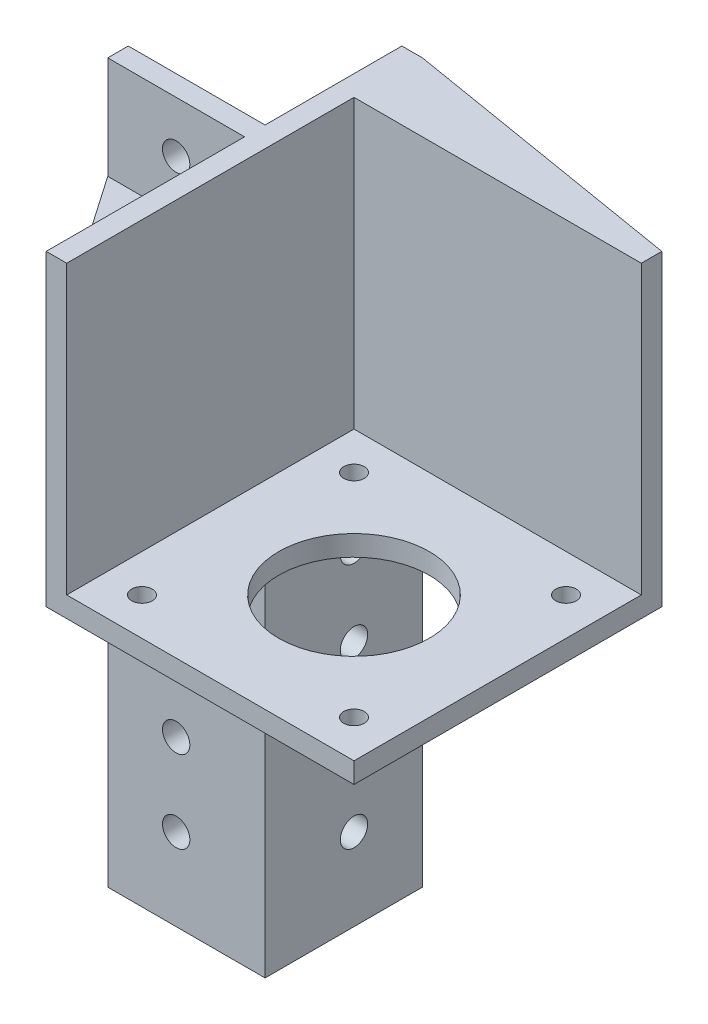
ISO-10303-21;
HEADER;
FILE_DESCRIPTION(('STEP AP214'),'2;1');
FILE_NAME('part.step','',(''),(''),'','','');
FILE_SCHEMA(('AUTOMOTIVE_DESIGN { 1 0 10303 214 1 1 1 1 }'));
ENDSEC;
DATA;
#1=APPLICATION_CONTEXT('core data for automotive mechanical design processes');
#2=APPLICATION_PROTOCOL_DEFINITION('international standard','automotive_design',2000,#1);
#3=PRODUCT_CONTEXT('',#1,'mechanical');
#4=PRODUCT('Part','Part','',(#3));
#5=PRODUCT_RELATED_PRODUCT_CATEGORY('part','',(#4));
#6=PRODUCT_DEFINITION_FORMATION('','',#4);
#7=PRODUCT_DEFINITION_CONTEXT('part definition',#1,'design');
#8=PRODUCT_DEFINITION('design','',#6,#7);
#9=PRODUCT_DEFINITION_SHAPE('','',#8);
#10=(LENGTH_UNIT() NAMED_UNIT(*) SI_UNIT(.MILLI.,.METRE.));
#11=(NAMED_UNIT(*) PLANE_ANGLE_UNIT() SI_UNIT($,.RADIAN.));
#12=(NAMED_UNIT(*) SI_UNIT($,.STERADIAN.) SOLID_ANGLE_UNIT());
#13=UNCERTAINTY_MEASURE_WITH_UNIT(LENGTH_MEASURE(1.E-05),#10,'distance_accuracy_value','');
#14=(GEOMETRIC_REPRESENTATION_CONTEXT(3) GLOBAL_UNCERTAINTY_ASSIGNED_CONTEXT((#13)) GLOBAL_UNIT_ASSIGNED_CONTEXT((#10,
#11,#12)) REPRESENTATION_CONTEXT('',''));
#15=CARTESIAN_POINT('',(0.,0.,0.));
#16=DIRECTION('',(0.,0.,1.));
#17=DIRECTION('',(1.,0.,0.));
#18=AXIS2_PLACEMENT_3D('',#15,#16,#17);
#19=CARTESIAN_POINT('',(0.,0.,-8.));
#20=DIRECTION('',(0.,0.,1.));
#21=DIRECTION('',(1.,0.,0.));
#22=AXIS2_PLACEMENT_3D('',#19,#20,#21);
#23=PLANE('',#22);
#24=CARTESIAN_POINT('',(-34.,-12.,-8.));
#25=DIRECTION('',(0.,0.,1.));
#26=DIRECTION('',(1.,0.,0.));
#27=AXIS2_PLACEMENT_3D('',#24,#25,#26);
#28=CIRCLE('',#27,2.);
#29=CARTESIAN_POINT('',(-32.,-12.,-8.));
#30=VERTEX_POINT('',#29);
#31=EDGE_CURVE('E188',#30,#30,#28,.T.);
#32=ORIENTED_EDGE('',*,*,#31,.F.);
#33=EDGE_LOOP('',(#32));
#34=FACE_BOUND('',#33,.T.);
#35=CARTESIAN_POINT('',(-34.,-24.,-8.));
#36=DIRECTION('',(0.,0.,1.));
#37=DIRECTION('',(1.,0.,0.));
#38=AXIS2_PLACEMENT_3D('',#35,#36,#37);
#39=CIRCLE('',#38,2.);
#40=CARTESIAN_POINT('',(-32.,-24.,-8.));
#41=VERTEX_POINT('',#40);
#42=EDGE_CURVE('E191',#41,#41,#39,.T.);
#43=ORIENTED_EDGE('',*,*,#42,.F.);
#44=EDGE_LOOP('',(#43));
#45=FACE_BOUND('',#44,.T.);
#46=CARTESIAN_POINT('',(-34.,-36.,-8.));
#47=DIRECTION('',(0.,0.,1.));
#48=DIRECTION('',(1.,0.,0.));
#49=AXIS2_PLACEMENT_3D('',#46,#47,#48);
#50=CIRCLE('',#49,2.);
#51=CARTESIAN_POINT('',(-32.,-36.,-8.));
#52=VERTEX_POINT('',#51);
#53=EDGE_CURVE('E177',#52,#52,#50,.T.);
#54=ORIENTED_EDGE('',*,*,#53,.F.);
#55=EDGE_LOOP('',(#54));
#56=FACE_BOUND('',#55,.T.);
#57=CARTESIAN_POINT('',(-34.,-48.,-8.));
#58=DIRECTION('',(0.,0.,1.));
#59=DIRECTION('',(1.,0.,0.));
#60=AXIS2_PLACEMENT_3D('',#57,#58,#59);
#61=CIRCLE('',#60,2.);
#62=CARTESIAN_POINT('',(-32.,-48.,-8.));
#63=VERTEX_POINT('',#62);
#64=EDGE_CURVE('E173',#63,#63,#61,.T.);
#65=ORIENTED_EDGE('',*,*,#64,.F.);
#66=EDGE_LOOP('',(#65));
#67=FACE_BOUND('',#66,.T.);
#68=DIRECTION('',(-1.,0.,0.));
#69=VECTOR('',#68,1.);
#70=CARTESIAN_POINT('',(-21.,0.,-8.));
#71=LINE('',#70,#69);
#72=CARTESIAN_POINT('',(-21.,0.,-8.));
#73=VERTEX_POINT('',#72);
#74=CARTESIAN_POINT('',(-44.,0.,-8.));
#75=VERTEX_POINT('',#74);
#76=EDGE_CURVE('E63',#73,#75,#71,.T.);
#77=ORIENTED_EDGE('',*,*,#76,.T.);
#78=DIRECTION('',(0.,-1.,0.));
#79=VECTOR('',#78,1.);
#80=CARTESIAN_POINT('',(-44.,45.,-8.));
#81=LINE('',#80,#79);
#82=CARTESIAN_POINT('',(-44.,-60.,-8.));
#83=VERTEX_POINT('',#82);
#84=EDGE_CURVE('E218',#75,#83,#81,.T.);
#85=ORIENTED_EDGE('',*,*,#84,.T.);
#86=DIRECTION('',(1.,0.,0.));
#87=VECTOR('',#86,1.);
#88=CARTESIAN_POINT('',(-44.,-60.,-8.));
#89=LINE('',#88,#87);
#90=CARTESIAN_POINT('',(-21.,-60.,-8.));
#91=VERTEX_POINT('',#90);
#92=EDGE_CURVE('E222',#83,#91,#89,.T.);
#93=ORIENTED_EDGE('',*,*,#92,.T.);
#94=DIRECTION('',(0.,1.,0.));
#95=VECTOR('',#94,1.);
#96=CARTESIAN_POINT('',(-21.,0.,-8.));
#97=LINE('',#96,#95);
#98=EDGE_CURVE('E210',#91,#73,#97,.T.);
#99=ORIENTED_EDGE('',*,*,#98,.T.);
#100=EDGE_LOOP('',(#77,#85,#93,#99));
#101=FACE_BOUND('',#100,.T.);
#102=ADVANCED_FACE('F39',(#34,#45,#56,#67,#101),#23,.T.);
#103=CARTESIAN_POINT('',(0.,0.,0.));
#104=DIRECTION('',(0.,1.,0.));
#105=DIRECTION('',(0.,0.,1.));
#106=AXIS2_PLACEMENT_3D('',#103,#104,#105);
#107=PLANE('',#106);
#108=CARTESIAN_POINT('',(15.5,0.,-15.5));
#109=DIRECTION('',(0.,1.,0.));
#110=DIRECTION('',(0.,0.,1.));
#111=AXIS2_PLACEMENT_3D('',#108,#109,#110);
#112=CIRCLE('',#111,1.5);
#113=CARTESIAN_POINT('',(15.5,0.,-14.));
#114=VERTEX_POINT('',#113);
#115=EDGE_CURVE('E271',#114,#114,#112,.T.);
#116=ORIENTED_EDGE('',*,*,#115,.T.);
#117=EDGE_LOOP('',(#116));
#118=FACE_BOUND('',#117,.T.);
#119=CARTESIAN_POINT('',(-15.5,0.,-15.5));
#120=DIRECTION('',(0.,1.,0.));
#121=DIRECTION('',(0.,0.,-1.));
#122=AXIS2_PLACEMENT_3D('',#119,#120,#121);
#123=CIRCLE('',#122,1.5);
#124=CARTESIAN_POINT('',(-15.5,0.,-17.));
#125=VERTEX_POINT('',#124);
#126=EDGE_CURVE('E275',#125,#125,#123,.T.);
#127=ORIENTED_EDGE('',*,*,#126,.T.);
#128=EDGE_LOOP('',(#127));
#129=FACE_BOUND('',#128,.T.);
#130=CARTESIAN_POINT('',(15.5,0.,15.5));
#131=DIRECTION('',(0.,1.,0.));
#132=DIRECTION('',(0.,0.,-1.));
#133=AXIS2_PLACEMENT_3D('',#130,#131,#132);
#134=CIRCLE('',#133,1.5);
#135=CARTESIAN_POINT('',(15.5,0.,14.));
#136=VERTEX_POINT('',#135);
#137=EDGE_CURVE('E281',#136,#136,#134,.T.);
#138=ORIENTED_EDGE('',*,*,#137,.T.);
#139=EDGE_LOOP('',(#138));
#140=FACE_BOUND('',#139,.T.);
#141=CARTESIAN_POINT('',(-15.5,0.,15.5));
#142=DIRECTION('',(0.,1.,0.));
#143=DIRECTION('',(0.,0.,1.));
#144=AXIS2_PLACEMENT_3D('',#141,#142,#143);
#145=CIRCLE('',#144,1.5);
#146=CARTESIAN_POINT('',(-15.5,0.,17.));
#147=VERTEX_POINT('',#146);
#148=EDGE_CURVE('E287',#147,#147,#145,.T.);
#149=ORIENTED_EDGE('',*,*,#148,.T.);
#150=EDGE_LOOP('',(#149));
#151=FACE_BOUND('',#150,.T.);
#152=CARTESIAN_POINT('',(0.,0.,0.));
#153=DIRECTION('',(0.,1.,0.));
#154=DIRECTION('',(0.,0.,1.));
#155=AXIS2_PLACEMENT_3D('',#152,#153,#154);
#156=CIRCLE('',#155,11.);
#157=CARTESIAN_POINT('',(0.,0.,11.));
#158=VERTEX_POINT('',#157);
#159=EDGE_CURVE('E293',#158,#158,#156,.T.);
#160=ORIENTED_EDGE('',*,*,#159,.T.);
#161=EDGE_LOOP('',(#160));
#162=FACE_BOUND('',#161,.T.);
#163=ORIENTED_EDGE('',*,*,#76,.F.);
#164=DIRECTION('',(0.,0.,1.));
#165=VECTOR('',#164,1.);
#166=CARTESIAN_POINT('',(-21.,0.,-21.));
#167=LINE('',#166,#165);
#168=CARTESIAN_POINT('',(-21.,0.,-31.));
#169=VERTEX_POINT('',#168);
#170=EDGE_CURVE('E56',#169,#73,#167,.T.);
#171=ORIENTED_EDGE('',*,*,#170,.F.);
#172=DIRECTION('',(0.986393923832144,0.,0.164398987305357));
#173=VECTOR('',#172,1.);
#174=CARTESIAN_POINT('',(21.,0.,-24.));
#175=LINE('',#174,#173);
#176=CARTESIAN_POINT('',(21.,0.,-24.));
#177=VERTEX_POINT('',#176);
#178=EDGE_CURVE('E174',#169,#177,#175,.T.);
#179=ORIENTED_EDGE('',*,*,#178,.T.);
#180=DIRECTION('',(0.,0.,-1.));
#181=VECTOR('',#180,1.);
#182=CARTESIAN_POINT('',(21.,0.,-21.));
#183=LINE('',#182,#181);
#184=CARTESIAN_POINT('',(21.,0.,21.));
#185=VERTEX_POINT('',#184);
#186=EDGE_CURVE('E155',#185,#177,#183,.T.);
#187=ORIENTED_EDGE('',*,*,#186,.F.);
#188=DIRECTION('',(1.,0.,0.));
#189=VECTOR('',#188,1.);
#190=CARTESIAN_POINT('',(-21.,0.,21.));
#191=LINE('',#190,#189);
#192=CARTESIAN_POINT('',(-24.,0.,21.));
#193=VERTEX_POINT('',#192);
#194=EDGE_CURVE('E305',#193,#185,#191,.T.);
#195=ORIENTED_EDGE('',*,*,#194,.F.);
#196=DIRECTION('',(-0.567732955803659,0.,-0.823212785915307));
#197=VECTOR('',#196,1.);
#198=CARTESIAN_POINT('',(-24.,0.,21.));
#199=LINE('',#198,#197);
#200=EDGE_CURVE('E200',#193,#75,#199,.T.);
#201=ORIENTED_EDGE('',*,*,#200,.T.);
#202=EDGE_LOOP('',(#163,#171,#179,#187,#195,#201));
#203=FACE_BOUND('',#202,.T.);
#204=ADVANCED_FACE('F345',(#118,#129,#140,#151,#162,#203),#107,.F.);
#205=CARTESIAN_POINT('',(-24.,0.,0.));
#206=DIRECTION('',(-1.,0.,0.));
#207=DIRECTION('',(0.,0.,1.));
#208=AXIS2_PLACEMENT_3D('',#205,#206,#207);
#209=PLANE('',#208);
#210=CARTESIAN_POINT('',(-24.,-48.,-21.));
#211=DIRECTION('',(-1.,0.,0.));
#212=DIRECTION('',(0.,0.,1.));
#213=AXIS2_PLACEMENT_3D('',#210,#211,#212);
#214=CIRCLE('',#213,2.);
#215=CARTESIAN_POINT('',(-24.,-48.,-19.));
#216=VERTEX_POINT('',#215);
#217=EDGE_CURVE('E179',#216,#216,#214,.T.);
#218=ORIENTED_EDGE('',*,*,#217,.F.);
#219=EDGE_LOOP('',(#218));
#220=FACE_BOUND('',#219,.T.);
#221=CARTESIAN_POINT('',(-24.,-36.,-21.));
#222=DIRECTION('',(-1.,0.,0.));
#223=DIRECTION('',(0.,0.,1.));
#224=AXIS2_PLACEMENT_3D('',#221,#222,#223);
#225=CIRCLE('',#224,2.);
#226=CARTESIAN_POINT('',(-24.,-36.,-19.));
#227=VERTEX_POINT('',#226);
#228=EDGE_CURVE('E697',#227,#227,#225,.T.);
#229=ORIENTED_EDGE('',*,*,#228,.F.);
#230=EDGE_LOOP('',(#229));
#231=FACE_BOUND('',#230,.T.);
#232=CARTESIAN_POINT('',(-24.,-12.,-21.));
#233=DIRECTION('',(-1.,0.,0.));
#234=DIRECTION('',(0.,0.,1.));
#235=AXIS2_PLACEMENT_3D('',#232,#233,#234);
#236=CIRCLE('',#235,2.);
#237=CARTESIAN_POINT('',(-24.,-12.,-19.));
#238=VERTEX_POINT('',#237);
#239=EDGE_CURVE('E695',#238,#238,#236,.T.);
#240=ORIENTED_EDGE('',*,*,#239,.F.);
#241=EDGE_LOOP('',(#240));
#242=FACE_BOUND('',#241,.T.);
#243=CARTESIAN_POINT('',(-24.,-24.,-21.));
#244=DIRECTION('',(-1.,0.,0.));
#245=DIRECTION('',(0.,0.,1.));
#246=AXIS2_PLACEMENT_3D('',#243,#244,#245);
#247=CIRCLE('',#246,2.);
#248=CARTESIAN_POINT('',(-24.,-24.,-19.));
#249=VERTEX_POINT('',#248);
#250=EDGE_CURVE('E692',#249,#249,#247,.T.);
#251=ORIENTED_EDGE('',*,*,#250,.F.);
#252=EDGE_LOOP('',(#251));
#253=FACE_BOUND('',#252,.T.);
#254=DIRECTION('',(0.,1.,0.));
#255=VECTOR('',#254,1.);
#256=CARTESIAN_POINT('',(-24.,0.,-11.));
#257=LINE('',#256,#255);
#258=CARTESIAN_POINT('',(-24.,-60.,-11.));
#259=VERTEX_POINT('',#258);
#260=CARTESIAN_POINT('',(-24.,45.,-11.));
#261=VERTEX_POINT('',#260);
#262=EDGE_CURVE('E254',#259,#261,#257,.T.);
#263=ORIENTED_EDGE('',*,*,#262,.T.);
#264=DIRECTION('',(0.,0.,-1.));
#265=VECTOR('',#264,1.);
#266=CARTESIAN_POINT('',(-24.,45.,-31.));
#267=LINE('',#266,#265);
#268=CARTESIAN_POINT('',(-24.,45.,-31.));
#269=VERTEX_POINT('',#268);
#270=EDGE_CURVE('E244',#261,#269,#267,.T.);
#271=ORIENTED_EDGE('',*,*,#270,.T.);
#272=DIRECTION('',(0.,-1.,0.));
#273=VECTOR('',#272,1.);
#274=CARTESIAN_POINT('',(-24.,-60.,-31.));
#275=LINE('',#274,#273);
#276=CARTESIAN_POINT('',(-24.,-60.,-31.));
#277=VERTEX_POINT('',#276);
#278=EDGE_CURVE('E249',#269,#277,#275,.T.);
#279=ORIENTED_EDGE('',*,*,#278,.T.);
#280=DIRECTION('',(0.,0.,1.));
#281=VECTOR('',#280,1.);
#282=CARTESIAN_POINT('',(-24.,-60.,-11.));
#283=LINE('',#282,#281);
#284=EDGE_CURVE('E251',#277,#259,#283,.T.);
#285=ORIENTED_EDGE('',*,*,#284,.T.);
#286=EDGE_LOOP('',(#263,#271,#279,#285));
#287=FACE_BOUND('',#286,.T.);
#288=ADVANCED_FACE('F354',(#220,#231,#242,#253,#287),#209,.T.);
#289=CARTESIAN_POINT('',(-21.,0.,0.));
#290=DIRECTION('',(-1.,0.,0.));
#291=DIRECTION('',(0.,0.,1.));
#292=AXIS2_PLACEMENT_3D('',#289,#290,#291);
#293=PLANE('',#292);
#294=CARTESIAN_POINT('',(-21.,-48.,-21.));
#295=DIRECTION('',(1.,0.,0.));
#296=DIRECTION('',(0.,0.,-1.));
#297=AXIS2_PLACEMENT_3D('',#294,#295,#296);
#298=CIRCLE('',#297,2.);
#299=CARTESIAN_POINT('',(-21.,-48.,-23.));
#300=VERTEX_POINT('',#299);
#301=EDGE_CURVE('E681',#300,#300,#298,.T.);
#302=ORIENTED_EDGE('',*,*,#301,.F.);
#303=EDGE_LOOP('',(#302));
#304=FACE_BOUND('',#303,.T.);
#305=CARTESIAN_POINT('',(-21.,-36.,-21.));
#306=DIRECTION('',(1.,0.,0.));
#307=DIRECTION('',(0.,0.,-1.));
#308=AXIS2_PLACEMENT_3D('',#305,#306,#307);
#309=CIRCLE('',#308,2.);
#310=CARTESIAN_POINT('',(-21.,-36.,-23.));
#311=VERTEX_POINT('',#310);
#312=EDGE_CURVE('E682',#311,#311,#309,.T.);
#313=ORIENTED_EDGE('',*,*,#312,.F.);
#314=EDGE_LOOP('',(#313));
#315=FACE_BOUND('',#314,.T.);
#316=CARTESIAN_POINT('',(-21.,-12.,-21.));
#317=DIRECTION('',(1.,0.,0.));
#318=DIRECTION('',(0.,0.,-1.));
#319=AXIS2_PLACEMENT_3D('',#316,#317,#318);
#320=CIRCLE('',#319,2.);
#321=CARTESIAN_POINT('',(-21.,-12.,-23.));
#322=VERTEX_POINT('',#321);
#323=EDGE_CURVE('E685',#322,#322,#320,.T.);
#324=ORIENTED_EDGE('',*,*,#323,.F.);
#325=EDGE_LOOP('',(#324));
#326=FACE_BOUND('',#325,.T.);
#327=CARTESIAN_POINT('',(-21.,-24.,-21.));
#328=DIRECTION('',(1.,0.,0.));
#329=DIRECTION('',(0.,0.,-1.));
#330=AXIS2_PLACEMENT_3D('',#327,#328,#329);
#331=CIRCLE('',#330,2.);
#332=CARTESIAN_POINT('',(-21.,-24.,-23.));
#333=VERTEX_POINT('',#332);
#334=EDGE_CURVE('E689',#333,#333,#331,.T.);
#335=ORIENTED_EDGE('',*,*,#334,.F.);
#336=EDGE_LOOP('',(#335));
#337=FACE_BOUND('',#336,.T.);
#338=DIRECTION('',(0.,-1.,0.));
#339=VECTOR('',#338,1.);
#340=CARTESIAN_POINT('',(-21.,-60.,-31.));
#341=LINE('',#340,#339);
#342=CARTESIAN_POINT('',(-21.,-60.,-31.));
#343=VERTEX_POINT('',#342);
#344=EDGE_CURVE('E260',#169,#343,#341,.T.);
#345=ORIENTED_EDGE('',*,*,#344,.F.);
#346=ORIENTED_EDGE('',*,*,#170,.T.);
#347=ORIENTED_EDGE('',*,*,#98,.F.);
#348=DIRECTION('',(0.,0.,1.));
#349=VECTOR('',#348,1.);
#350=CARTESIAN_POINT('',(-21.,-60.,-11.));
#351=LINE('',#350,#349);
#352=EDGE_CURVE('E262',#343,#91,#351,.T.);
#353=ORIENTED_EDGE('',*,*,#352,.F.);
#354=EDGE_LOOP('',(#345,#346,#347,#353));
#355=FACE_BOUND('',#354,.T.);
#356=ADVANCED_FACE('F435',(#304,#315,#326,#337,#355),#293,.F.);
#357=CARTESIAN_POINT('',(0.,3.,0.));
#358=DIRECTION('',(0.,1.,0.));
#359=DIRECTION('',(0.,0.,1.));
#360=AXIS2_PLACEMENT_3D('',#357,#358,#359);
#361=PLANE('',#360);
#362=CARTESIAN_POINT('',(-15.5,3.,-15.5));
#363=DIRECTION('',(0.,1.,0.));
#364=DIRECTION('',(0.,0.,-1.));
#365=AXIS2_PLACEMENT_3D('',#362,#363,#364);
#366=CIRCLE('',#365,1.5);
#367=CARTESIAN_POINT('',(-15.5,3.,-17.));
#368=VERTEX_POINT('',#367);
#369=EDGE_CURVE('E278',#368,#368,#366,.T.);
#370=ORIENTED_EDGE('',*,*,#369,.F.);
#371=EDGE_LOOP('',(#370));
#372=FACE_BOUND('',#371,.T.);
#373=CARTESIAN_POINT('',(-15.5,3.,15.5));
#374=DIRECTION('',(0.,1.,0.));
#375=DIRECTION('',(0.,0.,1.));
#376=AXIS2_PLACEMENT_3D('',#373,#374,#375);
#377=CIRCLE('',#376,1.5);
#378=CARTESIAN_POINT('',(-15.5,3.,17.));
#379=VERTEX_POINT('',#378);
#380=EDGE_CURVE('E290',#379,#379,#377,.T.);
#381=ORIENTED_EDGE('',*,*,#380,.F.);
#382=EDGE_LOOP('',(#381));
#383=FACE_BOUND('',#382,.T.);
#384=DIRECTION('',(0.,0.,-1.));
#385=VECTOR('',#384,1.);
#386=CARTESIAN_POINT('',(21.,3.,-21.));
#387=LINE('',#386,#385);
#388=CARTESIAN_POINT('',(21.,3.,21.));
#389=VERTEX_POINT('',#388);
#390=CARTESIAN_POINT('',(21.,3.,-21.));
#391=VERTEX_POINT('',#390);
#392=EDGE_CURVE('E301',#389,#391,#387,.T.);
#393=ORIENTED_EDGE('',*,*,#392,.T.);
#394=DIRECTION('',(-1.,0.,0.));
#395=VECTOR('',#394,1.);
#396=CARTESIAN_POINT('',(-21.,3.,-21.));
#397=LINE('',#396,#395);
#398=CARTESIAN_POINT('',(-21.,3.,-21.));
#399=VERTEX_POINT('',#398);
#400=EDGE_CURVE('E304',#391,#399,#397,.T.);
#401=ORIENTED_EDGE('',*,*,#400,.T.);
#402=DIRECTION('',(0.,0.,1.));
#403=VECTOR('',#402,1.);
#404=CARTESIAN_POINT('',(-21.,3.,-21.));
#405=LINE('',#404,#403);
#406=CARTESIAN_POINT('',(-21.,3.,21.));
#407=VERTEX_POINT('',#406);
#408=EDGE_CURVE('E308',#399,#407,#405,.T.);
#409=ORIENTED_EDGE('',*,*,#408,.T.);
#410=DIRECTION('',(1.,0.,0.));
#411=VECTOR('',#410,1.);
#412=CARTESIAN_POINT('',(-21.,3.,21.));
#413=LINE('',#412,#411);
#414=EDGE_CURVE('E48',#407,#389,#413,.T.);
#415=ORIENTED_EDGE('',*,*,#414,.T.);
#416=EDGE_LOOP('',(#393,#401,#409,#415));
#417=FACE_BOUND('',#416,.T.);
#418=CARTESIAN_POINT('',(0.,3.,0.));
#419=DIRECTION('',(0.,1.,0.));
#420=DIRECTION('',(0.,0.,1.));
#421=AXIS2_PLACEMENT_3D('',#418,#419,#420);
#422=CIRCLE('',#421,11.);
#423=CARTESIAN_POINT('',(0.,3.,11.));
#424=VERTEX_POINT('',#423);
#425=EDGE_CURVE('E296',#424,#424,#422,.T.);
#426=ORIENTED_EDGE('',*,*,#425,.F.);
#427=EDGE_LOOP('',(#426));
#428=FACE_BOUND('',#427,.T.);
#429=CARTESIAN_POINT('',(15.5,3.,15.5));
#430=DIRECTION('',(0.,1.,0.));
#431=DIRECTION('',(0.,0.,-1.));
#432=AXIS2_PLACEMENT_3D('',#429,#430,#431);
#433=CIRCLE('',#432,1.5);
#434=CARTESIAN_POINT('',(15.5,3.,14.));
#435=VERTEX_POINT('',#434);
#436=EDGE_CURVE('E284',#435,#435,#433,.T.);
#437=ORIENTED_EDGE('',*,*,#436,.F.);
#438=EDGE_LOOP('',(#437));
#439=FACE_BOUND('',#438,.T.);
#440=CARTESIAN_POINT('',(15.5,3.,-15.5));
#441=DIRECTION('',(0.,1.,0.));
#442=DIRECTION('',(0.,0.,1.));
#443=AXIS2_PLACEMENT_3D('',#440,#441,#442);
#444=CIRCLE('',#443,1.5);
#445=CARTESIAN_POINT('',(15.5,3.,-14.));
#446=VERTEX_POINT('',#445);
#447=EDGE_CURVE('E272',#446,#446,#444,.T.);
#448=ORIENTED_EDGE('',*,*,#447,.F.);
#449=EDGE_LOOP('',(#448));
#450=FACE_BOUND('',#449,.T.);
#451=ADVANCED_FACE('F446',(#372,#383,#417,#428,#439,#450),#361,.T.);
#452=CARTESIAN_POINT('',(21.,3.,-21.));
#453=DIRECTION('',(-1.,0.,0.));
#454=DIRECTION('',(0.,0.,1.));
#455=AXIS2_PLACEMENT_3D('',#452,#453,#454);
#456=PLANE('',#455);
#457=ORIENTED_EDGE('',*,*,#186,.T.);
#458=DIRECTION('',(0.,-1.,0.));
#459=VECTOR('',#458,1.);
#460=CARTESIAN_POINT('',(21.,0.,-24.));
#461=LINE('',#460,#459);
#462=CARTESIAN_POINT('',(21.,45.,-24.));
#463=VERTEX_POINT('',#462);
#464=EDGE_CURVE('E149',#463,#177,#461,.T.);
#465=ORIENTED_EDGE('',*,*,#464,.F.);
#466=DIRECTION('',(0.,0.,1.));
#467=VECTOR('',#466,1.);
#468=CARTESIAN_POINT('',(21.,45.,-24.));
#469=LINE('',#468,#467);
#470=CARTESIAN_POINT('',(21.,45.,-21.));
#471=VERTEX_POINT('',#470);
#472=EDGE_CURVE('E152',#463,#471,#469,.T.);
#473=ORIENTED_EDGE('',*,*,#472,.T.);
#474=DIRECTION('',(0.,-1.,0.));
#475=VECTOR('',#474,1.);
#476=CARTESIAN_POINT('',(21.,0.,-21.));
#477=LINE('',#476,#475);
#478=EDGE_CURVE('E235',#471,#391,#477,.T.);
#479=ORIENTED_EDGE('',*,*,#478,.T.);
#480=ORIENTED_EDGE('',*,*,#392,.F.);
#481=DIRECTION('',(0.,-1.,0.));
#482=VECTOR('',#481,1.);
#483=CARTESIAN_POINT('',(21.,3.,21.));
#484=LINE('',#483,#482);
#485=EDGE_CURVE('E11',#389,#185,#484,.T.);
#486=ORIENTED_EDGE('',*,*,#485,.T.);
#487=EDGE_LOOP('',(#457,#465,#473,#479,#480,#486));
#488=FACE_BOUND('',#487,.T.);
#489=ADVANCED_FACE('F41',(#488),#456,.F.);
#490=CARTESIAN_POINT('',(-21.,3.,21.));
#491=DIRECTION('',(0.,0.,-1.));
#492=DIRECTION('',(-1.,0.,0.));
#493=AXIS2_PLACEMENT_3D('',#490,#491,#492);
#494=PLANE('',#493);
#495=ORIENTED_EDGE('',*,*,#194,.T.);
#496=ORIENTED_EDGE('',*,*,#485,.F.);
#497=ORIENTED_EDGE('',*,*,#414,.F.);
#498=DIRECTION('',(0.,1.,0.));
#499=VECTOR('',#498,1.);
#500=CARTESIAN_POINT('',(-21.,45.,21.));
#501=LINE('',#500,#499);
#502=CARTESIAN_POINT('',(-21.,45.,21.));
#503=VERTEX_POINT('',#502);
#504=EDGE_CURVE('E168',#407,#503,#501,.T.);
#505=ORIENTED_EDGE('',*,*,#504,.T.);
#506=DIRECTION('',(1.,0.,0.));
#507=VECTOR('',#506,1.);
#508=CARTESIAN_POINT('',(-24.,45.,21.));
#509=LINE('',#508,#507);
#510=CARTESIAN_POINT('',(-24.,45.,21.));
#511=VERTEX_POINT('',#510);
#512=EDGE_CURVE('E268',#511,#503,#509,.T.);
#513=ORIENTED_EDGE('',*,*,#512,.F.);
#514=DIRECTION('',(0.,1.,0.));
#515=VECTOR('',#514,1.);
#516=CARTESIAN_POINT('',(-24.,45.,21.));
#517=LINE('',#516,#515);
#518=CARTESIAN_POINT('',(-24.,30.,21.));
#519=VERTEX_POINT('',#518);
#520=EDGE_CURVE('E245',#519,#511,#517,.T.);
#521=ORIENTED_EDGE('',*,*,#520,.F.);
#522=EDGE_CURVE('E242',#193,#519,#517,.T.);
#523=ORIENTED_EDGE('',*,*,#522,.F.);
#524=EDGE_LOOP('',(#495,#496,#497,#505,#513,#521,#523));
#525=FACE_BOUND('',#524,.T.);
#526=ADVANCED_FACE('F438',(#525),#494,.F.);
#527=CARTESIAN_POINT('',(0.,3.,0.));
#528=DIRECTION('',(0.,-1.,0.));
#529=DIRECTION('',(0.,0.,-1.));
#530=AXIS2_PLACEMENT_3D('',#527,#528,#529);
#531=CYLINDRICAL_SURFACE('',#530,11.);
#532=ORIENTED_EDGE('',*,*,#425,.T.);
#533=EDGE_LOOP('',(#532));
#534=FACE_BOUND('',#533,.T.);
#535=ORIENTED_EDGE('',*,*,#159,.F.);
#536=EDGE_LOOP('',(#535));
#537=FACE_BOUND('',#536,.T.);
#538=ADVANCED_FACE('F473',(#534,#537),#531,.F.);
#539=CARTESIAN_POINT('',(-15.5,3.,15.5));
#540=DIRECTION('',(0.,-1.,0.));
#541=DIRECTION('',(0.,0.,-1.));
#542=AXIS2_PLACEMENT_3D('',#539,#540,#541);
#543=CYLINDRICAL_SURFACE('',#542,1.5);
#544=ORIENTED_EDGE('',*,*,#380,.T.);
#545=EDGE_LOOP('',(#544));
#546=FACE_BOUND('',#545,.T.);
#547=ORIENTED_EDGE('',*,*,#148,.F.);
#548=EDGE_LOOP('',(#547));
#549=FACE_BOUND('',#548,.T.);
#550=ADVANCED_FACE('F475',(#546,#549),#543,.F.);
#551=CARTESIAN_POINT('',(15.5,3.,15.5));
#552=DIRECTION('',(0.,-1.,0.));
#553=DIRECTION('',(0.,0.,-1.));
#554=AXIS2_PLACEMENT_3D('',#551,#552,#553);
#555=CYLINDRICAL_SURFACE('',#554,1.5);
#556=ORIENTED_EDGE('',*,*,#436,.T.);
#557=EDGE_LOOP('',(#556));
#558=FACE_BOUND('',#557,.T.);
#559=ORIENTED_EDGE('',*,*,#137,.F.);
#560=EDGE_LOOP('',(#559));
#561=FACE_BOUND('',#560,.T.);
#562=ADVANCED_FACE('F482',(#558,#561),#555,.F.);
#563=CARTESIAN_POINT('',(-15.5,3.,-15.5));
#564=DIRECTION('',(0.,-1.,0.));
#565=DIRECTION('',(0.,0.,-1.));
#566=AXIS2_PLACEMENT_3D('',#563,#564,#565);
#567=CYLINDRICAL_SURFACE('',#566,1.5);
#568=ORIENTED_EDGE('',*,*,#369,.T.);
#569=EDGE_LOOP('',(#568));
#570=FACE_BOUND('',#569,.T.);
#571=ORIENTED_EDGE('',*,*,#126,.F.);
#572=EDGE_LOOP('',(#571));
#573=FACE_BOUND('',#572,.T.);
#574=ADVANCED_FACE('F461',(#570,#573),#567,.F.);
#575=CARTESIAN_POINT('',(15.5,3.,-15.5));
#576=DIRECTION('',(0.,-1.,0.));
#577=DIRECTION('',(0.,0.,-1.));
#578=AXIS2_PLACEMENT_3D('',#575,#576,#577);
#579=CYLINDRICAL_SURFACE('',#578,1.5);
#580=ORIENTED_EDGE('',*,*,#447,.T.);
#581=EDGE_LOOP('',(#580));
#582=FACE_BOUND('',#581,.T.);
#583=ORIENTED_EDGE('',*,*,#115,.F.);
#584=EDGE_LOOP('',(#583));
#585=FACE_BOUND('',#584,.T.);
#586=ADVANCED_FACE('F458',(#582,#585),#579,.F.);
#587=ORIENTED_EDGE('',*,*,#408,.F.);
#588=DIRECTION('',(0.,1.,0.));
#589=VECTOR('',#588,1.);
#590=CARTESIAN_POINT('',(-21.,0.,-21.));
#591=LINE('',#590,#589);
#592=CARTESIAN_POINT('',(-21.,45.,-21.));
#593=VERTEX_POINT('',#592);
#594=EDGE_CURVE('E238',#399,#593,#591,.T.);
#595=ORIENTED_EDGE('',*,*,#594,.T.);
#596=DIRECTION('',(0.,0.,-1.));
#597=VECTOR('',#596,1.);
#598=CARTESIAN_POINT('',(-21.,45.,-31.));
#599=LINE('',#598,#597);
#600=EDGE_CURVE('E258',#503,#593,#599,.T.);
#601=ORIENTED_EDGE('',*,*,#600,.F.);
#602=ORIENTED_EDGE('',*,*,#504,.F.);
#603=EDGE_LOOP('',(#587,#595,#601,#602));
#604=FACE_BOUND('',#603,.T.);
#605=ADVANCED_FACE('F443',(#604),#293,.F.);
#606=CARTESIAN_POINT('',(-24.,45.,-31.));
#607=DIRECTION('',(0.,-1.,0.));
#608=DIRECTION('',(0.,0.,-1.));
#609=AXIS2_PLACEMENT_3D('',#606,#607,#608);
#610=PLANE('',#609);
#611=DIRECTION('',(-0.986393923832144,0.,-0.164398987305357));
#612=VECTOR('',#611,1.);
#613=CARTESIAN_POINT('',(21.,45.,-24.));
#614=LINE('',#613,#612);
#615=CARTESIAN_POINT('',(-21.,45.,-31.));
#616=VERTEX_POINT('',#615);
#617=EDGE_CURVE('E165',#463,#616,#614,.T.);
#618=ORIENTED_EDGE('',*,*,#617,.T.);
#619=DIRECTION('',(1.,0.,0.));
#620=VECTOR('',#619,1.);
#621=CARTESIAN_POINT('',(-24.,45.,-31.));
#622=LINE('',#621,#620);
#623=EDGE_CURVE('E266',#269,#616,#622,.T.);
#624=ORIENTED_EDGE('',*,*,#623,.F.);
#625=ORIENTED_EDGE('',*,*,#270,.F.);
#626=DIRECTION('',(-1.,0.,0.));
#627=VECTOR('',#626,1.);
#628=CARTESIAN_POINT('',(-24.,45.,-11.));
#629=LINE('',#628,#627);
#630=CARTESIAN_POINT('',(-44.,45.,-11.));
#631=VERTEX_POINT('',#630);
#632=EDGE_CURVE('E209',#261,#631,#629,.T.);
#633=ORIENTED_EDGE('',*,*,#632,.T.);
#634=DIRECTION('',(0.,0.,-1.));
#635=VECTOR('',#634,1.);
#636=CARTESIAN_POINT('',(-44.,45.,-8.));
#637=LINE('',#636,#635);
#638=CARTESIAN_POINT('',(-44.,45.,-8.));
#639=VERTEX_POINT('',#638);
#640=EDGE_CURVE('E233',#639,#631,#637,.T.);
#641=ORIENTED_EDGE('',*,*,#640,.F.);
#642=DIRECTION('',(-1.,0.,0.));
#643=VECTOR('',#642,1.);
#644=CARTESIAN_POINT('',(-24.,45.,-8.));
#645=LINE('',#644,#643);
#646=CARTESIAN_POINT('',(-24.,45.,-8.));
#647=VERTEX_POINT('',#646);
#648=EDGE_CURVE('E216',#647,#639,#645,.T.);
#649=ORIENTED_EDGE('',*,*,#648,.F.);
#650=EDGE_CURVE('E246',#511,#647,#267,.T.);
#651=ORIENTED_EDGE('',*,*,#650,.F.);
#652=ORIENTED_EDGE('',*,*,#512,.T.);
#653=ORIENTED_EDGE('',*,*,#600,.T.);
#654=DIRECTION('',(1.,0.,0.));
#655=VECTOR('',#654,1.);
#656=CARTESIAN_POINT('',(21.,45.,-21.));
#657=LINE('',#656,#655);
#658=EDGE_CURVE('E159',#593,#471,#657,.T.);
#659=ORIENTED_EDGE('',*,*,#658,.T.);
#660=ORIENTED_EDGE('',*,*,#472,.F.);
#661=EDGE_LOOP('',(#618,#624,#625,#633,#641,#649,#651,#652,#653,#659,#660));
#662=FACE_BOUND('',#661,.T.);
#663=ADVANCED_FACE('F163',(#662),#610,.F.);
#664=CARTESIAN_POINT('',(-24.,-60.,-31.));
#665=DIRECTION('',(0.,0.,1.));
#666=DIRECTION('',(1.,0.,0.));
#667=AXIS2_PLACEMENT_3D('',#664,#665,#666);
#668=PLANE('',#667);
#669=EDGE_CURVE('E172',#616,#169,#341,.T.);
#670=ORIENTED_EDGE('',*,*,#669,.T.);
#671=ORIENTED_EDGE('',*,*,#344,.T.);
#672=DIRECTION('',(1.,0.,0.));
#673=VECTOR('',#672,1.);
#674=CARTESIAN_POINT('',(-24.,-60.,-31.));
#675=LINE('',#674,#673);
#676=EDGE_CURVE('E256',#277,#343,#675,.T.);
#677=ORIENTED_EDGE('',*,*,#676,.F.);
#678=ORIENTED_EDGE('',*,*,#278,.F.);
#679=ORIENTED_EDGE('',*,*,#623,.T.);
#680=EDGE_LOOP('',(#670,#671,#677,#678,#679));
#681=FACE_BOUND('',#680,.T.);
#682=ADVANCED_FACE('F431',(#681),#668,.F.);
#683=CARTESIAN_POINT('',(-24.,-60.,-11.));
#684=DIRECTION('',(0.,1.,0.));
#685=DIRECTION('',(0.,0.,1.));
#686=AXIS2_PLACEMENT_3D('',#683,#684,#685);
#687=PLANE('',#686);
#688=ORIENTED_EDGE('',*,*,#352,.T.);
#689=ORIENTED_EDGE('',*,*,#92,.F.);
#690=DIRECTION('',(0.,0.,-1.));
#691=VECTOR('',#690,1.);
#692=CARTESIAN_POINT('',(-44.,-60.,-8.));
#693=LINE('',#692,#691);
#694=CARTESIAN_POINT('',(-44.,-60.,-11.));
#695=VERTEX_POINT('',#694);
#696=EDGE_CURVE('E225',#83,#695,#693,.T.);
#697=ORIENTED_EDGE('',*,*,#696,.T.);
#698=DIRECTION('',(1.,0.,0.));
#699=VECTOR('',#698,1.);
#700=CARTESIAN_POINT('',(-44.,-60.,-11.));
#701=LINE('',#700,#699);
#702=EDGE_CURVE('E212',#695,#259,#701,.T.);
#703=ORIENTED_EDGE('',*,*,#702,.T.);
#704=ORIENTED_EDGE('',*,*,#284,.F.);
#705=ORIENTED_EDGE('',*,*,#676,.T.);
#706=EDGE_LOOP('',(#688,#689,#697,#703,#704,#705));
#707=FACE_BOUND('',#706,.T.);
#708=ADVANCED_FACE('F426',(#707),#687,.F.);
#709=DIRECTION('',(0.,0.,1.));
#710=VECTOR('',#709,1.);
#711=CARTESIAN_POINT('',(-24.,30.,-8.));
#712=LINE('',#711,#710);
#713=CARTESIAN_POINT('',(-24.,30.,-8.));
#714=VERTEX_POINT('',#713);
#715=EDGE_CURVE('E196',#714,#519,#712,.T.);
#716=ORIENTED_EDGE('',*,*,#715,.T.);
#717=ORIENTED_EDGE('',*,*,#520,.T.);
#718=ORIENTED_EDGE('',*,*,#650,.T.);
#719=DIRECTION('',(0.,1.,0.));
#720=VECTOR('',#719,1.);
#721=CARTESIAN_POINT('',(-24.,45.,-8.));
#722=LINE('',#721,#720);
#723=EDGE_CURVE('E214',#714,#647,#722,.T.);
#724=ORIENTED_EDGE('',*,*,#723,.F.);
#725=EDGE_LOOP('',(#716,#717,#718,#724));
#726=FACE_BOUND('',#725,.T.);
#727=ADVANCED_FACE('F381',(#726),#209,.T.);
#728=CARTESIAN_POINT('',(0.,0.,-21.));
#729=DIRECTION('',(0.,0.,1.));
#730=DIRECTION('',(1.,0.,0.));
#731=AXIS2_PLACEMENT_3D('',#728,#729,#730);
#732=PLANE('',#731);
#733=ORIENTED_EDGE('',*,*,#594,.F.);
#734=ORIENTED_EDGE('',*,*,#400,.F.);
#735=ORIENTED_EDGE('',*,*,#478,.F.);
#736=ORIENTED_EDGE('',*,*,#658,.F.);
#737=EDGE_LOOP('',(#733,#734,#735,#736));
#738=FACE_BOUND('',#737,.T.);
#739=ADVANCED_FACE('F368',(#738),#732,.T.);
#740=CARTESIAN_POINT('',(-44.,45.,-8.));
#741=DIRECTION('',(1.,0.,0.));
#742=DIRECTION('',(0.,1.,0.));
#743=AXIS2_PLACEMENT_3D('',#740,#741,#742);
#744=PLANE('',#743);
#745=DIRECTION('',(0.,-1.,0.));
#746=VECTOR('',#745,1.);
#747=CARTESIAN_POINT('',(-44.,45.,-11.));
#748=LINE('',#747,#746);
#749=EDGE_CURVE('E227',#631,#695,#748,.T.);
#750=ORIENTED_EDGE('',*,*,#749,.T.);
#751=ORIENTED_EDGE('',*,*,#696,.F.);
#752=ORIENTED_EDGE('',*,*,#84,.F.);
#753=DIRECTION('',(0.,-1.,0.));
#754=VECTOR('',#753,1.);
#755=CARTESIAN_POINT('',(-44.,30.,-8.));
#756=LINE('',#755,#754);
#757=CARTESIAN_POINT('',(-44.,30.,-8.));
#758=VERTEX_POINT('',#757);
#759=EDGE_CURVE('E205',#758,#75,#756,.T.);
#760=ORIENTED_EDGE('',*,*,#759,.F.);
#761=EDGE_CURVE('E219',#639,#758,#81,.T.);
#762=ORIENTED_EDGE('',*,*,#761,.F.);
#763=ORIENTED_EDGE('',*,*,#640,.T.);
#764=EDGE_LOOP('',(#750,#751,#752,#760,#762,#763));
#765=FACE_BOUND('',#764,.T.);
#766=ADVANCED_FACE('F361',(#765),#744,.F.);
#767=CARTESIAN_POINT('',(-34.,37.5,-8.));
#768=DIRECTION('',(0.,0.,1.));
#769=DIRECTION('',(1.,0.,0.));
#770=AXIS2_PLACEMENT_3D('',#767,#768,#769);
#771=CIRCLE('',#770,2.);
#772=CARTESIAN_POINT('',(-32.,37.5,-8.));
#773=VERTEX_POINT('',#772);
#774=EDGE_CURVE('E184',#773,#773,#771,.T.);
#775=ORIENTED_EDGE('',*,*,#774,.F.);
#776=EDGE_LOOP('',(#775));
#777=FACE_BOUND('',#776,.T.);
#778=DIRECTION('',(1.,0.,0.));
#779=VECTOR('',#778,1.);
#780=CARTESIAN_POINT('',(-44.,30.,-8.));
#781=LINE('',#780,#779);
#782=EDGE_CURVE('E202',#758,#714,#781,.T.);
#783=ORIENTED_EDGE('',*,*,#782,.T.);
#784=ORIENTED_EDGE('',*,*,#723,.T.);
#785=ORIENTED_EDGE('',*,*,#648,.T.);
#786=ORIENTED_EDGE('',*,*,#761,.T.);
#787=EDGE_LOOP('',(#783,#784,#785,#786));
#788=FACE_BOUND('',#787,.T.);
#789=ADVANCED_FACE('F348',(#777,#788),#23,.T.);
#790=CARTESIAN_POINT('',(0.,0.,-11.));
#791=DIRECTION('',(0.,0.,1.));
#792=DIRECTION('',(1.,0.,0.));
#793=AXIS2_PLACEMENT_3D('',#790,#791,#792);
#794=PLANE('',#793);
#795=CARTESIAN_POINT('',(-34.,37.5,-11.));
#796=DIRECTION('',(0.,0.,1.));
#797=DIRECTION('',(1.,0.,0.));
#798=AXIS2_PLACEMENT_3D('',#795,#796,#797);
#799=CIRCLE('',#798,2.);
#800=CARTESIAN_POINT('',(-32.,37.5,-11.));
#801=VERTEX_POINT('',#800);
#802=EDGE_CURVE('E43',#801,#801,#799,.T.);
#803=ORIENTED_EDGE('',*,*,#802,.T.);
#804=EDGE_LOOP('',(#803));
#805=FACE_BOUND('',#804,.T.);
#806=CARTESIAN_POINT('',(-34.,-12.,-11.));
#807=DIRECTION('',(0.,0.,1.));
#808=DIRECTION('',(1.,0.,0.));
#809=AXIS2_PLACEMENT_3D('',#806,#807,#808);
#810=CIRCLE('',#809,2.);
#811=CARTESIAN_POINT('',(-32.,-12.,-11.));
#812=VERTEX_POINT('',#811);
#813=EDGE_CURVE('E321',#812,#812,#810,.T.);
#814=ORIENTED_EDGE('',*,*,#813,.T.);
#815=EDGE_LOOP('',(#814));
#816=FACE_BOUND('',#815,.T.);
#817=CARTESIAN_POINT('',(-34.,-24.,-11.));
#818=DIRECTION('',(0.,0.,1.));
#819=DIRECTION('',(1.,0.,0.));
#820=AXIS2_PLACEMENT_3D('',#817,#818,#819);
#821=CIRCLE('',#820,2.);
#822=CARTESIAN_POINT('',(-32.,-24.,-11.));
#823=VERTEX_POINT('',#822);
#824=EDGE_CURVE('E319',#823,#823,#821,.T.);
#825=ORIENTED_EDGE('',*,*,#824,.T.);
#826=EDGE_LOOP('',(#825));
#827=FACE_BOUND('',#826,.T.);
#828=CARTESIAN_POINT('',(-34.,-36.,-11.));
#829=DIRECTION('',(0.,0.,1.));
#830=DIRECTION('',(1.,0.,0.));
#831=AXIS2_PLACEMENT_3D('',#828,#829,#830);
#832=CIRCLE('',#831,2.);
#833=CARTESIAN_POINT('',(-32.,-36.,-11.));
#834=VERTEX_POINT('',#833);
#835=EDGE_CURVE('E316',#834,#834,#832,.T.);
#836=ORIENTED_EDGE('',*,*,#835,.T.);
#837=EDGE_LOOP('',(#836));
#838=FACE_BOUND('',#837,.T.);
#839=CARTESIAN_POINT('',(-34.,-48.,-11.));
#840=DIRECTION('',(0.,0.,1.));
#841=DIRECTION('',(1.,0.,0.));
#842=AXIS2_PLACEMENT_3D('',#839,#840,#841);
#843=CIRCLE('',#842,2.);
#844=CARTESIAN_POINT('',(-32.,-48.,-11.));
#845=VERTEX_POINT('',#844);
#846=EDGE_CURVE('E187',#845,#845,#843,.T.);
#847=ORIENTED_EDGE('',*,*,#846,.T.);
#848=EDGE_LOOP('',(#847));
#849=FACE_BOUND('',#848,.T.);
#850=ORIENTED_EDGE('',*,*,#262,.F.);
#851=ORIENTED_EDGE('',*,*,#702,.F.);
#852=ORIENTED_EDGE('',*,*,#749,.F.);
#853=ORIENTED_EDGE('',*,*,#632,.F.);
#854=EDGE_LOOP('',(#850,#851,#852,#853));
#855=FACE_BOUND('',#854,.T.);
#856=ADVANCED_FACE('F328',(#805,#816,#827,#838,#849,#855),#794,.F.);
#857=CARTESIAN_POINT('',(-24.,30.,21.));
#858=DIRECTION('',(-0.823212785915306,0.,0.567732955803659));
#859=DIRECTION('',(0.567732955803659,0.,0.823212785915307));
#860=AXIS2_PLACEMENT_3D('',#857,#858,#859);
#861=PLANE('',#860);
#862=ORIENTED_EDGE('',*,*,#200,.F.);
#863=ORIENTED_EDGE('',*,*,#522,.T.);
#864=DIRECTION('',(-0.567732955803659,0.,-0.823212785915307));
#865=VECTOR('',#864,1.);
#866=CARTESIAN_POINT('',(-24.,30.,21.));
#867=LINE('',#866,#865);
#868=EDGE_CURVE('E199',#519,#758,#867,.T.);
#869=ORIENTED_EDGE('',*,*,#868,.T.);
#870=ORIENTED_EDGE('',*,*,#759,.T.);
#871=EDGE_LOOP('',(#862,#863,#869,#870));
#872=FACE_BOUND('',#871,.T.);
#873=ADVANCED_FACE('F366',(#872),#861,.T.);
#874=CARTESIAN_POINT('',(0.,30.,0.));
#875=DIRECTION('',(0.,1.,0.));
#876=DIRECTION('',(0.,0.,1.));
#877=AXIS2_PLACEMENT_3D('',#874,#875,#876);
#878=PLANE('',#877);
#879=ORIENTED_EDGE('',*,*,#715,.F.);
#880=ORIENTED_EDGE('',*,*,#782,.F.);
#881=ORIENTED_EDGE('',*,*,#868,.F.);
#882=EDGE_LOOP('',(#879,#880,#881));
#883=FACE_BOUND('',#882,.T.);
#884=ADVANCED_FACE('F395',(#883),#878,.T.);
#885=CARTESIAN_POINT('',(-34.,-48.,-31.));
#886=DIRECTION('',(0.,0.,1.));
#887=DIRECTION('',(1.,0.,0.));
#888=AXIS2_PLACEMENT_3D('',#885,#886,#887);
#889=CYLINDRICAL_SURFACE('',#888,2.);
#890=ORIENTED_EDGE('',*,*,#64,.T.);
#891=EDGE_LOOP('',(#890));
#892=FACE_BOUND('',#891,.T.);
#893=ORIENTED_EDGE('',*,*,#846,.F.);
#894=EDGE_LOOP('',(#893));
#895=FACE_BOUND('',#894,.T.);
#896=ADVANCED_FACE('F397',(#892,#895),#889,.F.);
#897=CARTESIAN_POINT('',(-34.,-36.,-31.));
#898=DIRECTION('',(0.,0.,1.));
#899=DIRECTION('',(1.,0.,0.));
#900=AXIS2_PLACEMENT_3D('',#897,#898,#899);
#901=CYLINDRICAL_SURFACE('',#900,2.);
#902=ORIENTED_EDGE('',*,*,#53,.T.);
#903=EDGE_LOOP('',(#902));
#904=FACE_BOUND('',#903,.T.);
#905=ORIENTED_EDGE('',*,*,#835,.F.);
#906=EDGE_LOOP('',(#905));
#907=FACE_BOUND('',#906,.T.);
#908=ADVANCED_FACE('F402',(#904,#907),#901,.F.);
#909=CARTESIAN_POINT('',(-34.,-24.,-31.));
#910=DIRECTION('',(0.,0.,1.));
#911=DIRECTION('',(1.,0.,0.));
#912=AXIS2_PLACEMENT_3D('',#909,#910,#911);
#913=CYLINDRICAL_SURFACE('',#912,2.);
#914=ORIENTED_EDGE('',*,*,#42,.T.);
#915=EDGE_LOOP('',(#914));
#916=FACE_BOUND('',#915,.T.);
#917=ORIENTED_EDGE('',*,*,#824,.F.);
#918=EDGE_LOOP('',(#917));
#919=FACE_BOUND('',#918,.T.);
#920=ADVANCED_FACE('F341',(#916,#919),#913,.F.);
#921=CARTESIAN_POINT('',(-34.,-12.,-31.));
#922=DIRECTION('',(0.,0.,1.));
#923=DIRECTION('',(1.,0.,0.));
#924=AXIS2_PLACEMENT_3D('',#921,#922,#923);
#925=CYLINDRICAL_SURFACE('',#924,2.);
#926=ORIENTED_EDGE('',*,*,#31,.T.);
#927=EDGE_LOOP('',(#926));
#928=FACE_BOUND('',#927,.T.);
#929=ORIENTED_EDGE('',*,*,#813,.F.);
#930=EDGE_LOOP('',(#929));
#931=FACE_BOUND('',#930,.T.);
#932=ADVANCED_FACE('F332',(#928,#931),#925,.F.);
#933=CARTESIAN_POINT('',(-34.,37.5,-31.));
#934=DIRECTION('',(0.,0.,1.));
#935=DIRECTION('',(1.,0.,0.));
#936=AXIS2_PLACEMENT_3D('',#933,#934,#935);
#937=CYLINDRICAL_SURFACE('',#936,2.);
#938=ORIENTED_EDGE('',*,*,#774,.T.);
#939=EDGE_LOOP('',(#938));
#940=FACE_BOUND('',#939,.T.);
#941=ORIENTED_EDGE('',*,*,#802,.F.);
#942=EDGE_LOOP('',(#941));
#943=FACE_BOUND('',#942,.T.);
#944=ADVANCED_FACE('F330',(#940,#943),#937,.F.);
#945=CARTESIAN_POINT('',(21.,87.5793377120875,-24.));
#946=DIRECTION('',(0.164398987305357,0.,-0.986393923832144));
#947=DIRECTION('',(-0.986393923832144,0.,-0.164398987305357));
#948=AXIS2_PLACEMENT_3D('',#945,#946,#947);
#949=PLANE('',#948);
#950=ORIENTED_EDGE('',*,*,#617,.F.);
#951=ORIENTED_EDGE('',*,*,#464,.T.);
#952=ORIENTED_EDGE('',*,*,#178,.F.);
#953=ORIENTED_EDGE('',*,*,#669,.F.);
#954=EDGE_LOOP('',(#950,#951,#952,#953));
#955=FACE_BOUND('',#954,.T.);
#956=ADVANCED_FACE('F170',(#955),#949,.T.);
#957=CARTESIAN_POINT('',(-44.,-24.,-21.));
#958=DIRECTION('',(1.,0.,0.));
#959=DIRECTION('',(0.,0.,-1.));
#960=AXIS2_PLACEMENT_3D('',#957,#958,#959);
#961=CYLINDRICAL_SURFACE('',#960,2.);
#962=ORIENTED_EDGE('',*,*,#250,.T.);
#963=EDGE_LOOP('',(#962));
#964=FACE_BOUND('',#963,.T.);
#965=ORIENTED_EDGE('',*,*,#334,.T.);
#966=EDGE_LOOP('',(#965));
#967=FACE_BOUND('',#966,.T.);
#968=ADVANCED_FACE('F339',(#964,#967),#961,.F.);
#969=CARTESIAN_POINT('',(-44.,-12.,-21.));
#970=DIRECTION('',(1.,0.,0.));
#971=DIRECTION('',(0.,0.,-1.));
#972=AXIS2_PLACEMENT_3D('',#969,#970,#971);
#973=CYLINDRICAL_SURFACE('',#972,2.);
#974=ORIENTED_EDGE('',*,*,#239,.T.);
#975=EDGE_LOOP('',(#974));
#976=FACE_BOUND('',#975,.T.);
#977=ORIENTED_EDGE('',*,*,#323,.T.);
#978=EDGE_LOOP('',(#977));
#979=FACE_BOUND('',#978,.T.);
#980=ADVANCED_FACE('F635',(#976,#979),#973,.F.);
#981=CARTESIAN_POINT('',(-44.,-36.,-21.));
#982=DIRECTION('',(1.,0.,0.));
#983=DIRECTION('',(0.,0.,-1.));
#984=AXIS2_PLACEMENT_3D('',#981,#982,#983);
#985=CYLINDRICAL_SURFACE('',#984,2.);
#986=ORIENTED_EDGE('',*,*,#228,.T.);
#987=EDGE_LOOP('',(#986));
#988=FACE_BOUND('',#987,.T.);
#989=ORIENTED_EDGE('',*,*,#312,.T.);
#990=EDGE_LOOP('',(#989));
#991=FACE_BOUND('',#990,.T.);
#992=ADVANCED_FACE('F646',(#988,#991),#985,.F.);
#993=CARTESIAN_POINT('',(-44.,-48.,-21.));
#994=DIRECTION('',(1.,0.,0.));
#995=DIRECTION('',(0.,0.,-1.));
#996=AXIS2_PLACEMENT_3D('',#993,#994,#995);
#997=CYLINDRICAL_SURFACE('',#996,2.);
#998=ORIENTED_EDGE('',*,*,#217,.T.);
#999=EDGE_LOOP('',(#998));
#1000=FACE_BOUND('',#999,.T.);
#1001=ORIENTED_EDGE('',*,*,#301,.T.);
#1002=EDGE_LOOP('',(#1001));
#1003=FACE_BOUND('',#1002,.T.);
#1004=ADVANCED_FACE('F657',(#1000,#1003),#997,.F.);
#1005=CLOSED_SHELL('',(#102,#204,#288,#356,#451,#489,#526,#538,#550,#562,#574,#586,#605,#663,
#682,#708,#727,#739,#766,#789,#856,#873,#884,#896,#908,#920,#932,#944,#956,#968,#980,#992,#1004));
#1006=MANIFOLD_SOLID_BREP('B2',#1005);
#1007=ADVANCED_BREP_SHAPE_REPRESENTATION('',(#18,#1006),#14);
#1008=SHAPE_DEFINITION_REPRESENTATION(#9,#1007);
ENDSEC;
END-ISO-10303-21;
